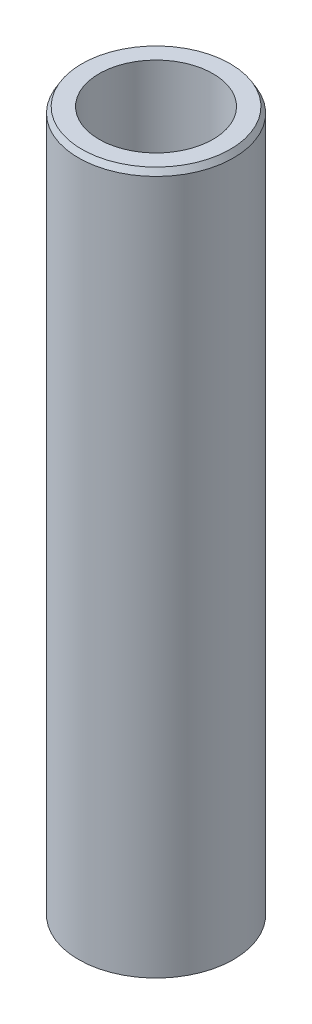
ISO-10303-21;
HEADER;
FILE_DESCRIPTION(('STEP AP214'),'2;1');
FILE_NAME('part.step','',(''),(''),'','','');
FILE_SCHEMA(('AUTOMOTIVE_DESIGN { 1 0 10303 214 1 1 1 1 }'));
ENDSEC;
DATA;
#1=APPLICATION_CONTEXT('core data for automotive mechanical design processes');
#2=APPLICATION_PROTOCOL_DEFINITION('international standard','automotive_design',2000,#1);
#3=PRODUCT_CONTEXT('',#1,'mechanical');
#4=PRODUCT('Part','Part','',(#3));
#5=PRODUCT_RELATED_PRODUCT_CATEGORY('part','',(#4));
#6=PRODUCT_DEFINITION_FORMATION('','',#4);
#7=PRODUCT_DEFINITION_CONTEXT('part definition',#1,'design');
#8=PRODUCT_DEFINITION('design','',#6,#7);
#9=PRODUCT_DEFINITION_SHAPE('','',#8);
#10=(LENGTH_UNIT() NAMED_UNIT(*) SI_UNIT(.MILLI.,.METRE.));
#11=(NAMED_UNIT(*) PLANE_ANGLE_UNIT() SI_UNIT($,.RADIAN.));
#12=(NAMED_UNIT(*) SI_UNIT($,.STERADIAN.) SOLID_ANGLE_UNIT());
#13=UNCERTAINTY_MEASURE_WITH_UNIT(LENGTH_MEASURE(1.E-05),#10,'distance_accuracy_value','');
#14=(GEOMETRIC_REPRESENTATION_CONTEXT(3) GLOBAL_UNCERTAINTY_ASSIGNED_CONTEXT((#13)) GLOBAL_UNIT_ASSIGNED_CONTEXT((#10,
#11,#12)) REPRESENTATION_CONTEXT('',''));
#15=CARTESIAN_POINT('',(0.,0.,0.));
#16=DIRECTION('',(0.,0.,1.));
#17=DIRECTION('',(1.,0.,0.));
#18=AXIS2_PLACEMENT_3D('',#15,#16,#17);
#19=CARTESIAN_POINT('',(0.,294.85062138714,0.));
#20=DIRECTION('',(0.,-1.,0.));
#21=DIRECTION('',(0.,0.,-1.));
#22=AXIS2_PLACEMENT_3D('',#19,#20,#21);
#23=CYLINDRICAL_SURFACE('',#22,32.5);
#24=CARTESIAN_POINT('',(0.,292.432870012721,0.));
#25=DIRECTION('',(0.,1.,0.));
#26=DIRECTION('',(0.,0.,1.));
#27=AXIS2_PLACEMENT_3D('',#24,#25,#26);
#28=CIRCLE('',#27,32.5);
#29=CARTESIAN_POINT('',(0.,292.432870012721,-32.5));
#30=VERTEX_POINT('',#29);
#31=EDGE_CURVE('E50',#30,#30,#28,.F.);
#32=ORIENTED_EDGE('',*,*,#31,.T.);
#33=EDGE_LOOP('',(#32));
#34=FACE_BOUND('',#33,.T.);
#35=CARTESIAN_POINT('',(0.,1.39588940685426,0.));
#36=DIRECTION('',(0.,1.,0.));
#37=DIRECTION('',(0.,0.,1.));
#38=AXIS2_PLACEMENT_3D('',#35,#36,#37);
#39=CIRCLE('',#38,32.5);
#40=CARTESIAN_POINT('',(0.,1.39588940685426,32.5));
#41=VERTEX_POINT('',#40);
#42=EDGE_CURVE('E51',#41,#41,#39,.T.);
#43=ORIENTED_EDGE('',*,*,#42,.T.);
#44=EDGE_LOOP('',(#43));
#45=FACE_BOUND('',#44,.T.);
#46=ADVANCED_FACE('F39',(#34,#45),#23,.T.);
#47=CARTESIAN_POINT('',(0.,294.85062138714,0.));
#48=DIRECTION('',(0.,1.,0.));
#49=DIRECTION('',(0.,0.,1.));
#50=AXIS2_PLACEMENT_3D('',#47,#48,#49);
#51=PLANE('',#50);
#52=CARTESIAN_POINT('',(0.,294.85062138714,0.));
#53=DIRECTION('',(0.,1.,0.));
#54=DIRECTION('',(0.,0.,1.));
#55=AXIS2_PLACEMENT_3D('',#52,#53,#54);
#56=CIRCLE('',#55,31.1041105931457);
#57=CARTESIAN_POINT('',(0.,294.85062138714,-31.1041105931457));
#58=VERTEX_POINT('',#57);
#59=EDGE_CURVE('E54',#58,#58,#56,.T.);
#60=ORIENTED_EDGE('',*,*,#59,.T.);
#61=EDGE_LOOP('',(#60));
#62=FACE_BOUND('',#61,.T.);
#63=CARTESIAN_POINT('',(0.,294.85062138714,0.));
#64=DIRECTION('',(0.,1.,0.));
#65=DIRECTION('',(0.,0.,1.));
#66=AXIS2_PLACEMENT_3D('',#63,#64,#65);
#67=CIRCLE('',#66,23.8724317148703);
#68=CARTESIAN_POINT('',(0.,294.85062138714,23.8724317148703));
#69=VERTEX_POINT('',#68);
#70=EDGE_CURVE('E58',#69,#69,#67,.T.);
#71=ORIENTED_EDGE('',*,*,#70,.F.);
#72=EDGE_LOOP('',(#71));
#73=FACE_BOUND('',#72,.T.);
#74=ADVANCED_FACE('F69',(#62,#73),#51,.T.);
#75=CARTESIAN_POINT('',(0.,0.,0.));
#76=DIRECTION('',(0.,1.,0.));
#77=DIRECTION('',(0.,0.,1.));
#78=AXIS2_PLACEMENT_3D('',#75,#76,#77);
#79=PLANE('',#78);
#80=CARTESIAN_POINT('',(0.,0.,0.));
#81=DIRECTION('',(0.,1.,0.));
#82=DIRECTION('',(0.,0.,1.));
#83=AXIS2_PLACEMENT_3D('',#80,#81,#82);
#84=CIRCLE('',#83,30.0822486255812);
#85=CARTESIAN_POINT('',(0.,0.,30.0822486255812));
#86=VERTEX_POINT('',#85);
#87=EDGE_CURVE('E10',#86,#86,#84,.F.);
#88=ORIENTED_EDGE('',*,*,#87,.T.);
#89=EDGE_LOOP('',(#88));
#90=FACE_BOUND('',#89,.T.);
#91=CARTESIAN_POINT('',(0.,0.,0.));
#92=DIRECTION('',(0.,1.,0.));
#93=DIRECTION('',(0.,0.,1.));
#94=AXIS2_PLACEMENT_3D('',#91,#92,#93);
#95=CIRCLE('',#94,23.8724317148703);
#96=CARTESIAN_POINT('',(0.,0.,23.8724317148703));
#97=VERTEX_POINT('',#96);
#98=EDGE_CURVE('E63',#97,#97,#95,.T.);
#99=ORIENTED_EDGE('',*,*,#98,.T.);
#100=EDGE_LOOP('',(#99));
#101=FACE_BOUND('',#100,.T.);
#102=ADVANCED_FACE('F75',(#90,#101),#79,.F.);
#103=CARTESIAN_POINT('',(0.,294.85062138714,0.));
#104=DIRECTION('',(0.,-1.,0.));
#105=DIRECTION('',(0.,0.,-1.));
#106=AXIS2_PLACEMENT_3D('',#103,#104,#105);
#107=CYLINDRICAL_SURFACE('',#106,23.8724317148703);
#108=ORIENTED_EDGE('',*,*,#70,.T.);
#109=EDGE_LOOP('',(#108));
#110=FACE_BOUND('',#109,.T.);
#111=ORIENTED_EDGE('',*,*,#98,.F.);
#112=EDGE_LOOP('',(#111));
#113=FACE_BOUND('',#112,.T.);
#114=ADVANCED_FACE('F70',(#110,#113),#107,.F.);
#115=CARTESIAN_POINT('',(0.,294.85062138714,0.));
#116=DIRECTION('',(0.,-1.,0.));
#117=DIRECTION('',(0.,0.,-1.));
#118=AXIS2_PLACEMENT_3D('',#115,#116,#117);
#119=CONICAL_SURFACE('',#118,31.1041105931457,0.52359877559829);
#120=CARTESIAN_POINT('',(0.,292.432870012721,-32.5));
#121=CARTESIAN_POINT('',(0.,292.458054922871,-32.4854594853453));
#122=CARTESIAN_POINT('',(0.,292.483239833021,-32.4709189706906));
#123=CARTESIAN_POINT('',(0.,292.533609653322,-32.4418379413811));
#124=CARTESIAN_POINT('',(0.,292.558794563472,-32.4272974267264));
#125=CARTESIAN_POINT('',(0.,292.609164383772,-32.3982163974169));
#126=CARTESIAN_POINT('',(0.,292.634349293923,-32.3836758827622));
#127=CARTESIAN_POINT('',(0.,292.684719114223,-32.3545948534527));
#128=CARTESIAN_POINT('',(0.,292.709904024373,-32.340054338798));
#129=CARTESIAN_POINT('',(0.,292.760273844674,-32.3109733094885));
#130=CARTESIAN_POINT('',(0.,292.785458754824,-32.2964327948338));
#131=CARTESIAN_POINT('',(0.,292.835828575124,-32.2673517655243));
#132=CARTESIAN_POINT('',(0.,292.861013485274,-32.2528112508696));
#133=CARTESIAN_POINT('',(0.,292.911383305575,-32.2237302215601));
#134=CARTESIAN_POINT('',(0.,292.936568215725,-32.2091897069054));
#135=CARTESIAN_POINT('',(0.,292.986938036025,-32.1801086775959));
#136=CARTESIAN_POINT('',(0.,293.012122946176,-32.1655681629412));
#137=CARTESIAN_POINT('',(0.,293.062492766476,-32.1364871336317));
#138=CARTESIAN_POINT('',(0.,293.087677676626,-32.121946618977));
#139=CARTESIAN_POINT('',(0.,293.138047496926,-32.0928655896675));
#140=CARTESIAN_POINT('',(0.,293.163232407077,-32.0783250750128));
#141=CARTESIAN_POINT('',(0.,293.213602227377,-32.0492440457033));
#142=CARTESIAN_POINT('',(0.,293.238787137527,-32.0347035310486));
#143=CARTESIAN_POINT('',(0.,293.289156957828,-32.0056225017391));
#144=CARTESIAN_POINT('',(0.,293.314341867978,-31.9910819870844));
#145=CARTESIAN_POINT('',(0.,293.364711688278,-31.9620009577749));
#146=CARTESIAN_POINT('',(0.,293.389896598428,-31.9474604431202));
#147=CARTESIAN_POINT('',(0.,293.440266418729,-31.9183794138107));
#148=CARTESIAN_POINT('',(0.,293.465451328879,-31.903838899156));
#149=CARTESIAN_POINT('',(0.,293.515821149179,-31.8747578698465));
#150=CARTESIAN_POINT('',(0.,293.54100605933,-31.8602173551918));
#151=CARTESIAN_POINT('',(0.,293.59137587963,-31.8311363258823));
#152=CARTESIAN_POINT('',(0.,293.61656078978,-31.8165958112276));
#153=CARTESIAN_POINT('',(0.,293.666930610081,-31.7875147819181));
#154=CARTESIAN_POINT('',(0.,293.692115520231,-31.7729742672634));
#155=CARTESIAN_POINT('',(0.,293.742485340531,-31.7438932379539));
#156=CARTESIAN_POINT('',(0.,293.767670250681,-31.7293527232992));
#157=CARTESIAN_POINT('',(0.,293.818040070982,-31.7002716939898));
#158=CARTESIAN_POINT('',(0.,293.843224981132,-31.685731179335));
#159=CARTESIAN_POINT('',(0.,293.893594801432,-31.6566501500255));
#160=CARTESIAN_POINT('',(0.,293.918779711583,-31.6421096353708));
#161=CARTESIAN_POINT('',(0.,293.969149531883,-31.6130286060614));
#162=CARTESIAN_POINT('',(0.,293.994334442033,-31.5984880914066));
#163=CARTESIAN_POINT('',(0.,294.044704262334,-31.5694070620972));
#164=CARTESIAN_POINT('',(0.,294.069889172484,-31.5548665474424));
#165=CARTESIAN_POINT('',(0.,294.120258992784,-31.525785518133));
#166=CARTESIAN_POINT('',(0.,294.145443902934,-31.5112450034782));
#167=CARTESIAN_POINT('',(0.,294.195813723235,-31.4821639741688));
#168=CARTESIAN_POINT('',(0.,294.220998633385,-31.467623459514));
#169=CARTESIAN_POINT('',(0.,294.271368453685,-31.4385424302046));
#170=CARTESIAN_POINT('',(0.,294.296553363836,-31.4240019155498));
#171=CARTESIAN_POINT('',(0.,294.346923184136,-31.3949208862404));
#172=CARTESIAN_POINT('',(0.,294.372108094286,-31.3803803715857));
#173=CARTESIAN_POINT('',(0.,294.422477914586,-31.3512993422762));
#174=CARTESIAN_POINT('',(0.,294.447662824737,-31.3367588276214));
#175=CARTESIAN_POINT('',(0.,294.498032645037,-31.307677798312));
#176=CARTESIAN_POINT('',(0.,294.523217555187,-31.2931372836573));
#177=CARTESIAN_POINT('',(0.,294.573587375488,-31.2640562543478));
#178=CARTESIAN_POINT('',(0.,294.598772285638,-31.2495157396931));
#179=CARTESIAN_POINT('',(0.,294.649142105938,-31.2204347103836));
#180=CARTESIAN_POINT('',(0.,294.674327016088,-31.2058941957289));
#181=CARTESIAN_POINT('',(0.,294.724696836389,-31.1768131664194));
#182=CARTESIAN_POINT('',(0.,294.749881746539,-31.1622726517647));
#183=CARTESIAN_POINT('',(0.,294.800251566839,-31.1331916224552));
#184=CARTESIAN_POINT('',(0.,294.82543647699,-31.1186511078005));
#185=CARTESIAN_POINT('',(0.,294.85062138714,-31.1041105931457));
#186=B_SPLINE_CURVE_WITH_KNOTS('',3,(#120,#121,#122,#123,#124,#125,#126,#127,#128,#129,#130,
#131,#132,#133,#134,#135,#136,#137,#138,#139,#140,#141,#142,#143,#144,#145,#146,#147,#148,#149,
#150,#151,#152,#153,#154,#155,#156,#157,#158,#159,#160,#161,#162,#163,#164,#165,#166,#167,#168,
#169,#170,#171,#172,#173,#174,#175,#176,#177,#178,#179,#180,#181,#182,#183,#184,#185),
.UNSPECIFIED.,.F.,.F.,(4,2,2,2,2,2,2,2,2,2,2,2,2,2,2,2,2,2,2,2,2,2,2,2,2,2,2,2,2,2,2,2,4),(0.,
0.0872430879284213,0.174486175856795,0.261729263785219,0.348972351713593,0.436215439642014,
0.523458527570391,0.610701615498764,0.697944703427189,0.785187791355562,0.872430879283983,
0.95967396721236,1.04691705514073,1.13416014306916,1.22140323099753,1.30864631892595,
1.39588940685433,1.4831324947827,1.57037558271112,1.6576186706395,1.74486175856792,
1.8321048464963,1.91934793442467,2.00659102235309,2.09383411028147,2.18107719820989,
2.26832028613826,2.35556337406664,2.44280646199506,2.53004954992344,2.61729263785186,
2.70453572578024,2.79177881370866),.UNSPECIFIED.);
#187=EDGE_CURVE('BSEAM81',#30,#58,#186,.T.);
#188=ORIENTED_EDGE('',*,*,#31,.F.);
#189=ORIENTED_EDGE('',*,*,#59,.F.);
#190=ORIENTED_EDGE('',*,*,#187,.T.);
#191=ORIENTED_EDGE('',*,*,#187,.F.);
#192=EDGE_LOOP('',(#188,#190,#189,#191));
#193=FACE_BOUND('',#192,.T.);
#194=ADVANCED_FACE('F81',(#193),#119,.T.);
#195=CARTESIAN_POINT('',(0.,1.39588940685426,0.));
#196=DIRECTION('',(0.,1.,0.));
#197=DIRECTION('',(0.,0.,1.));
#198=AXIS2_PLACEMENT_3D('',#195,#196,#197);
#199=CONICAL_SURFACE('',#198,32.5,1.0471975511966);
#200=ORIENTED_EDGE('',*,*,#87,.F.);
#201=EDGE_LOOP('',(#200));
#202=FACE_BOUND('',#201,.T.);
#203=ORIENTED_EDGE('',*,*,#42,.F.);
#204=EDGE_LOOP('',(#203));
#205=FACE_BOUND('',#204,.T.);
#206=ADVANCED_FACE('F45',(#202,#205),#199,.T.);
#207=CLOSED_SHELL('',(#46,#74,#102,#114,#194,#206));
#208=MANIFOLD_SOLID_BREP('B2',#207);
#209=ADVANCED_BREP_SHAPE_REPRESENTATION('',(#18,#208),#14);
#210=SHAPE_DEFINITION_REPRESENTATION(#9,#209);
ENDSEC;
END-ISO-10303-21;
